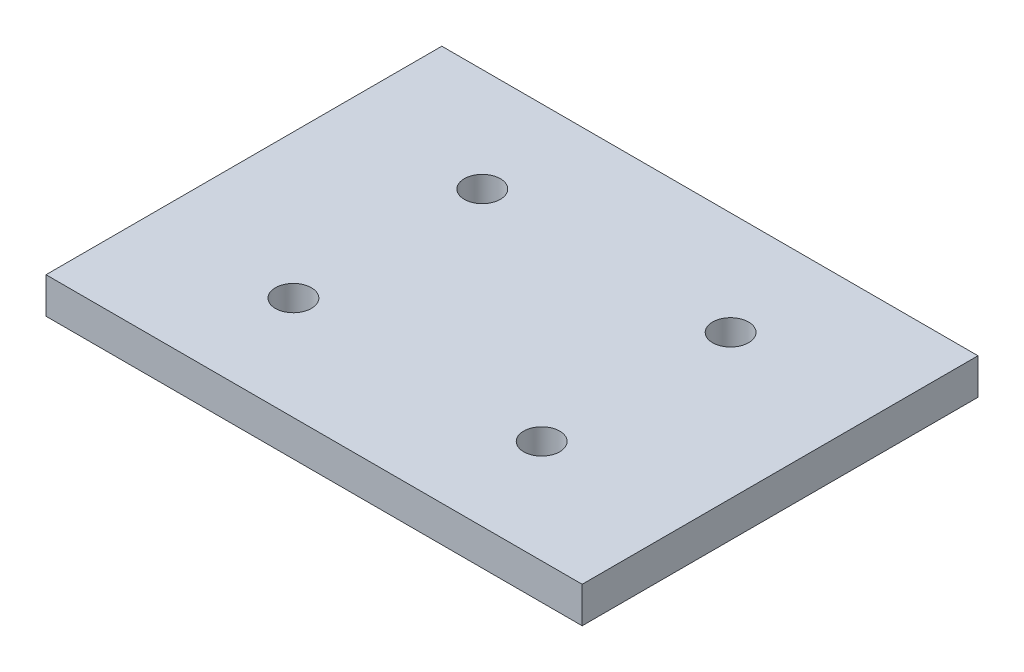
ISO-10303-21;
HEADER;
FILE_DESCRIPTION(('STEP AP214'),'2;1');
FILE_NAME('part.step','',(''),(''),'','','');
FILE_SCHEMA(('AUTOMOTIVE_DESIGN { 1 0 10303 214 1 1 1 1 }'));
ENDSEC;
DATA;
#1=APPLICATION_CONTEXT('core data for automotive mechanical design processes');
#2=APPLICATION_PROTOCOL_DEFINITION('international standard','automotive_design',2000,#1);
#3=PRODUCT_CONTEXT('',#1,'mechanical');
#4=PRODUCT('Part','Part','',(#3));
#5=PRODUCT_RELATED_PRODUCT_CATEGORY('part','',(#4));
#6=PRODUCT_DEFINITION_FORMATION('','',#4);
#7=PRODUCT_DEFINITION_CONTEXT('part definition',#1,'design');
#8=PRODUCT_DEFINITION('design','',#6,#7);
#9=PRODUCT_DEFINITION_SHAPE('','',#8);
#10=(LENGTH_UNIT() NAMED_UNIT(*) SI_UNIT(.MILLI.,.METRE.));
#11=(NAMED_UNIT(*) PLANE_ANGLE_UNIT() SI_UNIT($,.RADIAN.));
#12=(NAMED_UNIT(*) SI_UNIT($,.STERADIAN.) SOLID_ANGLE_UNIT());
#13=UNCERTAINTY_MEASURE_WITH_UNIT(LENGTH_MEASURE(1.E-05),#10,'distance_accuracy_value','');
#14=(GEOMETRIC_REPRESENTATION_CONTEXT(3) GLOBAL_UNCERTAINTY_ASSIGNED_CONTEXT((#13)) GLOBAL_UNIT_ASSIGNED_CONTEXT((#10,
#11,#12)) REPRESENTATION_CONTEXT('',''));
#15=CARTESIAN_POINT('',(0.,0.,0.));
#16=DIRECTION('',(0.,0.,1.));
#17=DIRECTION('',(1.,0.,0.));
#18=AXIS2_PLACEMENT_3D('',#15,#16,#17);
#19=CARTESIAN_POINT('',(14.9,2.,11.));
#20=DIRECTION('',(-1.,0.,0.));
#21=DIRECTION('',(0.,0.,1.));
#22=AXIS2_PLACEMENT_3D('',#19,#20,#21);
#23=PLANE('',#22);
#24=DIRECTION('',(0.,0.,-1.));
#25=VECTOR('',#24,1.);
#26=CARTESIAN_POINT('',(14.9,0.,11.));
#27=LINE('',#26,#25);
#28=CARTESIAN_POINT('',(14.9,0.,11.));
#29=VERTEX_POINT('',#28);
#30=CARTESIAN_POINT('',(14.9,0.,-11.));
#31=VERTEX_POINT('',#30);
#32=EDGE_CURVE('E95',#29,#31,#27,.T.);
#33=ORIENTED_EDGE('',*,*,#32,.T.);
#34=DIRECTION('',(0.,-1.,0.));
#35=VECTOR('',#34,1.);
#36=CARTESIAN_POINT('',(14.9,2.,-11.));
#37=LINE('',#36,#35);
#38=CARTESIAN_POINT('',(14.9,2.,-11.));
#39=VERTEX_POINT('',#38);
#40=EDGE_CURVE('E11',#39,#31,#37,.T.);
#41=ORIENTED_EDGE('',*,*,#40,.F.);
#42=DIRECTION('',(0.,0.,-1.));
#43=VECTOR('',#42,1.);
#44=CARTESIAN_POINT('',(14.9,2.,11.));
#45=LINE('',#44,#43);
#46=CARTESIAN_POINT('',(14.9,2.,11.));
#47=VERTEX_POINT('',#46);
#48=EDGE_CURVE('E83',#47,#39,#45,.T.);
#49=ORIENTED_EDGE('',*,*,#48,.F.);
#50=DIRECTION('',(0.,-1.,0.));
#51=VECTOR('',#50,1.);
#52=CARTESIAN_POINT('',(14.9,2.,11.));
#53=LINE('',#52,#51);
#54=EDGE_CURVE('E91',#47,#29,#53,.T.);
#55=ORIENTED_EDGE('',*,*,#54,.T.);
#56=EDGE_LOOP('',(#33,#41,#49,#55));
#57=FACE_BOUND('',#56,.T.);
#58=ADVANCED_FACE('F32',(#57),#23,.F.);
#59=CARTESIAN_POINT('',(-14.9,2.,-11.));
#60=DIRECTION('',(0.,0.,1.));
#61=DIRECTION('',(1.,0.,0.));
#62=AXIS2_PLACEMENT_3D('',#59,#60,#61);
#63=PLANE('',#62);
#64=DIRECTION('',(-1.,0.,0.));
#65=VECTOR('',#64,1.);
#66=CARTESIAN_POINT('',(-14.9,0.,-11.));
#67=LINE('',#66,#65);
#68=CARTESIAN_POINT('',(-14.9,0.,-11.));
#69=VERTEX_POINT('',#68);
#70=EDGE_CURVE('E87',#31,#69,#67,.T.);
#71=ORIENTED_EDGE('',*,*,#70,.T.);
#72=DIRECTION('',(0.,-1.,0.));
#73=VECTOR('',#72,1.);
#74=CARTESIAN_POINT('',(-14.9,2.,-11.));
#75=LINE('',#74,#73);
#76=CARTESIAN_POINT('',(-14.9,2.,-11.));
#77=VERTEX_POINT('',#76);
#78=EDGE_CURVE('E40',#77,#69,#75,.T.);
#79=ORIENTED_EDGE('',*,*,#78,.F.);
#80=DIRECTION('',(-1.,0.,0.));
#81=VECTOR('',#80,1.);
#82=CARTESIAN_POINT('',(-14.9,2.,-11.));
#83=LINE('',#82,#81);
#84=EDGE_CURVE('E78',#39,#77,#83,.T.);
#85=ORIENTED_EDGE('',*,*,#84,.F.);
#86=ORIENTED_EDGE('',*,*,#40,.T.);
#87=EDGE_LOOP('',(#71,#79,#85,#86));
#88=FACE_BOUND('',#87,.T.);
#89=ADVANCED_FACE('F86',(#88),#63,.F.);
#90=CARTESIAN_POINT('',(-14.9,2.,11.));
#91=DIRECTION('',(1.,0.,0.));
#92=DIRECTION('',(0.,0.,-1.));
#93=AXIS2_PLACEMENT_3D('',#90,#91,#92);
#94=PLANE('',#93);
#95=DIRECTION('',(0.,0.,1.));
#96=VECTOR('',#95,1.);
#97=CARTESIAN_POINT('',(-14.9,0.,11.));
#98=LINE('',#97,#96);
#99=CARTESIAN_POINT('',(-14.9,0.,11.));
#100=VERTEX_POINT('',#99);
#101=EDGE_CURVE('E65',#69,#100,#98,.T.);
#102=ORIENTED_EDGE('',*,*,#101,.T.);
#103=DIRECTION('',(0.,-1.,0.));
#104=VECTOR('',#103,1.);
#105=CARTESIAN_POINT('',(-14.9,2.,11.));
#106=LINE('',#105,#104);
#107=CARTESIAN_POINT('',(-14.9,2.,11.));
#108=VERTEX_POINT('',#107);
#109=EDGE_CURVE('E88',#108,#100,#106,.T.);
#110=ORIENTED_EDGE('',*,*,#109,.F.);
#111=DIRECTION('',(0.,0.,1.));
#112=VECTOR('',#111,1.);
#113=CARTESIAN_POINT('',(-14.9,2.,11.));
#114=LINE('',#113,#112);
#115=EDGE_CURVE('E81',#77,#108,#114,.T.);
#116=ORIENTED_EDGE('',*,*,#115,.F.);
#117=ORIENTED_EDGE('',*,*,#78,.T.);
#118=EDGE_LOOP('',(#102,#110,#116,#117));
#119=FACE_BOUND('',#118,.T.);
#120=ADVANCED_FACE('F89',(#119),#94,.F.);
#121=CARTESIAN_POINT('',(-14.9,2.,11.));
#122=DIRECTION('',(0.,0.,-1.));
#123=DIRECTION('',(-1.,0.,0.));
#124=AXIS2_PLACEMENT_3D('',#121,#122,#123);
#125=PLANE('',#124);
#126=DIRECTION('',(1.,0.,0.));
#127=VECTOR('',#126,1.);
#128=CARTESIAN_POINT('',(-14.9,0.,11.));
#129=LINE('',#128,#127);
#130=EDGE_CURVE('E71',#100,#29,#129,.T.);
#131=ORIENTED_EDGE('',*,*,#130,.T.);
#132=ORIENTED_EDGE('',*,*,#54,.F.);
#133=DIRECTION('',(1.,0.,0.));
#134=VECTOR('',#133,1.);
#135=CARTESIAN_POINT('',(-14.9,2.,11.));
#136=LINE('',#135,#134);
#137=EDGE_CURVE('E48',#108,#47,#136,.T.);
#138=ORIENTED_EDGE('',*,*,#137,.F.);
#139=ORIENTED_EDGE('',*,*,#109,.T.);
#140=EDGE_LOOP('',(#131,#132,#138,#139));
#141=FACE_BOUND('',#140,.T.);
#142=ADVANCED_FACE('F103',(#141),#125,.F.);
#143=CARTESIAN_POINT('',(0.,2.,0.));
#144=DIRECTION('',(0.,-1.,0.));
#145=DIRECTION('',(0.,0.,-1.));
#146=AXIS2_PLACEMENT_3D('',#143,#144,#145);
#147=PLANE('',#146);
#148=CARTESIAN_POINT('',(-6.9,2.,5.25));
#149=DIRECTION('',(0.,-1.,0.));
#150=DIRECTION('',(0.,0.,-1.));
#151=AXIS2_PLACEMENT_3D('',#148,#149,#150);
#152=CIRCLE('',#151,1.);
#153=CARTESIAN_POINT('',(-6.9,2.,4.25));
#154=VERTEX_POINT('',#153);
#155=EDGE_CURVE('E126',#154,#154,#152,.F.);
#156=ORIENTED_EDGE('',*,*,#155,.F.);
#157=EDGE_LOOP('',(#156));
#158=FACE_BOUND('',#157,.T.);
#159=CARTESIAN_POINT('',(6.9,2.,5.25));
#160=DIRECTION('',(0.,-1.,0.));
#161=DIRECTION('',(0.,0.,-1.));
#162=AXIS2_PLACEMENT_3D('',#159,#160,#161);
#163=CIRCLE('',#162,1.);
#164=CARTESIAN_POINT('',(6.9,2.,4.25));
#165=VERTEX_POINT('',#164);
#166=EDGE_CURVE('E120',#165,#165,#163,.F.);
#167=ORIENTED_EDGE('',*,*,#166,.F.);
#168=EDGE_LOOP('',(#167));
#169=FACE_BOUND('',#168,.T.);
#170=CARTESIAN_POINT('',(-6.9,2.,-5.25));
#171=DIRECTION('',(0.,-1.,0.));
#172=DIRECTION('',(0.,0.,-1.));
#173=AXIS2_PLACEMENT_3D('',#170,#171,#172);
#174=CIRCLE('',#173,1.);
#175=CARTESIAN_POINT('',(-6.9,2.,-6.25));
#176=VERTEX_POINT('',#175);
#177=EDGE_CURVE('E114',#176,#176,#174,.T.);
#178=ORIENTED_EDGE('',*,*,#177,.T.);
#179=EDGE_LOOP('',(#178));
#180=FACE_BOUND('',#179,.T.);
#181=CARTESIAN_POINT('',(6.9,2.,-5.25));
#182=DIRECTION('',(0.,-1.,0.));
#183=DIRECTION('',(0.,0.,-1.));
#184=AXIS2_PLACEMENT_3D('',#181,#182,#183);
#185=CIRCLE('',#184,1.);
#186=CARTESIAN_POINT('',(6.9,2.,-6.25));
#187=VERTEX_POINT('',#186);
#188=EDGE_CURVE('E98',#187,#187,#185,.T.);
#189=ORIENTED_EDGE('',*,*,#188,.T.);
#190=EDGE_LOOP('',(#189));
#191=FACE_BOUND('',#190,.T.);
#192=ORIENTED_EDGE('',*,*,#48,.T.);
#193=ORIENTED_EDGE('',*,*,#84,.T.);
#194=ORIENTED_EDGE('',*,*,#115,.T.);
#195=ORIENTED_EDGE('',*,*,#137,.T.);
#196=EDGE_LOOP('',(#192,#193,#194,#195));
#197=FACE_BOUND('',#196,.T.);
#198=ADVANCED_FACE('F79',(#158,#169,#180,#191,#197),#147,.F.);
#199=CARTESIAN_POINT('',(0.,0.,0.));
#200=DIRECTION('',(0.,-1.,0.));
#201=DIRECTION('',(0.,0.,-1.));
#202=AXIS2_PLACEMENT_3D('',#199,#200,#201);
#203=PLANE('',#202);
#204=CARTESIAN_POINT('',(-6.9,0.,5.25));
#205=DIRECTION('',(0.,1.,0.));
#206=DIRECTION('',(0.,0.,1.));
#207=AXIS2_PLACEMENT_3D('',#204,#205,#206);
#208=CIRCLE('',#207,1.);
#209=CARTESIAN_POINT('',(-6.9,0.,6.25));
#210=VERTEX_POINT('',#209);
#211=EDGE_CURVE('E129',#210,#210,#208,.T.);
#212=ORIENTED_EDGE('',*,*,#211,.T.);
#213=EDGE_LOOP('',(#212));
#214=FACE_BOUND('',#213,.T.);
#215=CARTESIAN_POINT('',(6.9,0.,5.25));
#216=DIRECTION('',(0.,1.,0.));
#217=DIRECTION('',(0.,0.,1.));
#218=AXIS2_PLACEMENT_3D('',#215,#216,#217);
#219=CIRCLE('',#218,1.);
#220=CARTESIAN_POINT('',(6.9,0.,6.25));
#221=VERTEX_POINT('',#220);
#222=EDGE_CURVE('E123',#221,#221,#219,.T.);
#223=ORIENTED_EDGE('',*,*,#222,.T.);
#224=EDGE_LOOP('',(#223));
#225=FACE_BOUND('',#224,.T.);
#226=CARTESIAN_POINT('',(-6.9,0.,-5.25));
#227=DIRECTION('',(0.,-1.,0.));
#228=DIRECTION('',(0.,0.,-1.));
#229=AXIS2_PLACEMENT_3D('',#226,#227,#228);
#230=CIRCLE('',#229,1.);
#231=CARTESIAN_POINT('',(-6.9,0.,-6.25));
#232=VERTEX_POINT('',#231);
#233=EDGE_CURVE('E117',#232,#232,#230,.T.);
#234=ORIENTED_EDGE('',*,*,#233,.F.);
#235=EDGE_LOOP('',(#234));
#236=FACE_BOUND('',#235,.T.);
#237=CARTESIAN_POINT('',(6.9,0.,-5.25));
#238=DIRECTION('',(0.,-1.,0.));
#239=DIRECTION('',(0.,0.,-1.));
#240=AXIS2_PLACEMENT_3D('',#237,#238,#239);
#241=CIRCLE('',#240,1.);
#242=CARTESIAN_POINT('',(6.9,0.,-6.25));
#243=VERTEX_POINT('',#242);
#244=EDGE_CURVE('E111',#243,#243,#241,.T.);
#245=ORIENTED_EDGE('',*,*,#244,.F.);
#246=EDGE_LOOP('',(#245));
#247=FACE_BOUND('',#246,.T.);
#248=ORIENTED_EDGE('',*,*,#32,.F.);
#249=ORIENTED_EDGE('',*,*,#130,.F.);
#250=ORIENTED_EDGE('',*,*,#101,.F.);
#251=ORIENTED_EDGE('',*,*,#70,.F.);
#252=EDGE_LOOP('',(#248,#249,#250,#251));
#253=FACE_BOUND('',#252,.T.);
#254=ADVANCED_FACE('F106',(#214,#225,#236,#247,#253),#203,.T.);
#255=CARTESIAN_POINT('',(6.9,10.,-5.25));
#256=DIRECTION('',(0.,-1.,0.));
#257=DIRECTION('',(0.,0.,-1.));
#258=AXIS2_PLACEMENT_3D('',#255,#256,#257);
#259=CYLINDRICAL_SURFACE('',#258,1.);
#260=ORIENTED_EDGE('',*,*,#244,.T.);
#261=EDGE_LOOP('',(#260));
#262=FACE_BOUND('',#261,.T.);
#263=ORIENTED_EDGE('',*,*,#188,.F.);
#264=EDGE_LOOP('',(#263));
#265=FACE_BOUND('',#264,.T.);
#266=ADVANCED_FACE('F151',(#262,#265),#259,.F.);
#267=CARTESIAN_POINT('',(-6.9,10.,-5.25));
#268=DIRECTION('',(0.,-1.,0.));
#269=DIRECTION('',(0.,0.,-1.));
#270=AXIS2_PLACEMENT_3D('',#267,#268,#269);
#271=CYLINDRICAL_SURFACE('',#270,1.);
#272=ORIENTED_EDGE('',*,*,#233,.T.);
#273=EDGE_LOOP('',(#272));
#274=FACE_BOUND('',#273,.T.);
#275=ORIENTED_EDGE('',*,*,#177,.F.);
#276=EDGE_LOOP('',(#275));
#277=FACE_BOUND('',#276,.T.);
#278=ADVANCED_FACE('F153',(#274,#277),#271,.F.);
#279=CARTESIAN_POINT('',(6.9,10.,5.25));
#280=DIRECTION('',(0.,-1.,0.));
#281=DIRECTION('',(0.,0.,-1.));
#282=AXIS2_PLACEMENT_3D('',#279,#280,#281);
#283=CYLINDRICAL_SURFACE('',#282,1.);
#284=ORIENTED_EDGE('',*,*,#222,.F.);
#285=EDGE_LOOP('',(#284));
#286=FACE_BOUND('',#285,.T.);
#287=ORIENTED_EDGE('',*,*,#166,.T.);
#288=EDGE_LOOP('',(#287));
#289=FACE_BOUND('',#288,.T.);
#290=ADVANCED_FACE('F138',(#286,#289),#283,.F.);
#291=CARTESIAN_POINT('',(-6.9,10.,5.25));
#292=DIRECTION('',(0.,-1.,0.));
#293=DIRECTION('',(0.,0.,-1.));
#294=AXIS2_PLACEMENT_3D('',#291,#292,#293);
#295=CYLINDRICAL_SURFACE('',#294,1.);
#296=ORIENTED_EDGE('',*,*,#211,.F.);
#297=EDGE_LOOP('',(#296));
#298=FACE_BOUND('',#297,.T.);
#299=ORIENTED_EDGE('',*,*,#155,.T.);
#300=EDGE_LOOP('',(#299));
#301=FACE_BOUND('',#300,.T.);
#302=ADVANCED_FACE('F135',(#298,#301),#295,.F.);
#303=CLOSED_SHELL('',(#58,#89,#120,#142,#198,#254,#266,#278,#290,#302));
#304=MANIFOLD_SOLID_BREP('B2',#303);
#305=ADVANCED_BREP_SHAPE_REPRESENTATION('',(#18,#304),#14);
#306=SHAPE_DEFINITION_REPRESENTATION(#9,#305);
ENDSEC;
END-ISO-10303-21;
